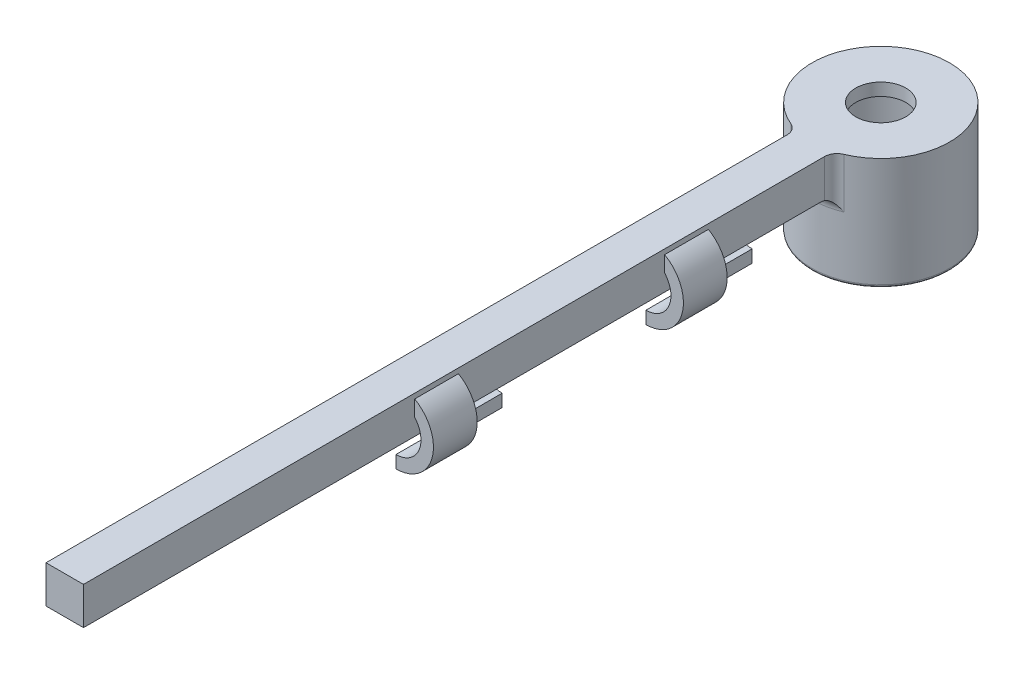
ISO-10303-21;
HEADER;
FILE_DESCRIPTION(('STEP AP214'),'2;1');
FILE_NAME('part.step','',(''),(''),'','','');
FILE_SCHEMA(('AUTOMOTIVE_DESIGN { 1 0 10303 214 1 1 1 1 }'));
ENDSEC;
DATA;
#1=APPLICATION_CONTEXT('core data for automotive mechanical design processes');
#2=APPLICATION_PROTOCOL_DEFINITION('international standard','automotive_design',2000,#1);
#3=PRODUCT_CONTEXT('',#1,'mechanical');
#4=PRODUCT('Part','Part','',(#3));
#5=PRODUCT_RELATED_PRODUCT_CATEGORY('part','',(#4));
#6=PRODUCT_DEFINITION_FORMATION('','',#4);
#7=PRODUCT_DEFINITION_CONTEXT('part definition',#1,'design');
#8=PRODUCT_DEFINITION('design','',#6,#7);
#9=PRODUCT_DEFINITION_SHAPE('','',#8);
#10=(LENGTH_UNIT() NAMED_UNIT(*) SI_UNIT(.MILLI.,.METRE.));
#11=(NAMED_UNIT(*) PLANE_ANGLE_UNIT() SI_UNIT($,.RADIAN.));
#12=(NAMED_UNIT(*) SI_UNIT($,.STERADIAN.) SOLID_ANGLE_UNIT());
#13=UNCERTAINTY_MEASURE_WITH_UNIT(LENGTH_MEASURE(1.E-05),#10,'distance_accuracy_value','');
#14=(GEOMETRIC_REPRESENTATION_CONTEXT(3) GLOBAL_UNCERTAINTY_ASSIGNED_CONTEXT((#13)) GLOBAL_UNIT_ASSIGNED_CONTEXT((#10,
#11,#12)) REPRESENTATION_CONTEXT('',''));
#15=CARTESIAN_POINT('',(0.,0.,0.));
#16=DIRECTION('',(0.,0.,1.));
#17=DIRECTION('',(1.,0.,0.));
#18=AXIS2_PLACEMENT_3D('',#15,#16,#17);
#19=CARTESIAN_POINT('',(0.,-9.,0.));
#20=DIRECTION('',(0.,1.,0.));
#21=DIRECTION('',(0.,0.,1.));
#22=AXIS2_PLACEMENT_3D('',#19,#20,#21);
#23=CYLINDRICAL_SURFACE('',#22,5.5);
#24=CARTESIAN_POINT('',(0.,-8.75,0.));
#25=DIRECTION('',(0.,1.,0.));
#26=DIRECTION('',(0.,0.,1.));
#27=AXIS2_PLACEMENT_3D('',#24,#25,#26);
#28=CIRCLE('',#27,5.5);
#29=CARTESIAN_POINT('',(0.,-8.75,5.5));
#30=VERTEX_POINT('',#29);
#31=EDGE_CURVE('E403',#30,#30,#28,.T.);
#32=ORIENTED_EDGE('',*,*,#31,.T.);
#33=EDGE_LOOP('',(#32));
#34=FACE_BOUND('',#33,.T.);
#35=DIRECTION('',(0.,1.,0.));
#36=VECTOR('',#35,1.);
#37=CARTESIAN_POINT('',(2.11538461538462,-9.,5.07692307692308));
#38=LINE('',#37,#36);
#39=CARTESIAN_POINT('',(2.11538461538462,0.,5.07692307692308));
#40=VERTEX_POINT('',#39);
#41=CARTESIAN_POINT('',(2.11538461538462,-4.,5.07692307692308));
#42=VERTEX_POINT('',#41);
#43=EDGE_CURVE('E315',#40,#42,#38,.F.);
#44=ORIENTED_EDGE('',*,*,#43,.T.);
#45=CARTESIAN_POINT('',(0.,-4.,0.));
#46=DIRECTION('',(0.,-1.,0.));
#47=DIRECTION('',(0.,0.,-1.));
#48=AXIS2_PLACEMENT_3D('',#45,#46,#47);
#49=CIRCLE('',#48,5.5);
#50=CARTESIAN_POINT('',(-2.11538461538461,-4.,5.07692307692308));
#51=VERTEX_POINT('',#50);
#52=EDGE_CURVE('E328',#42,#51,#49,.T.);
#53=ORIENTED_EDGE('',*,*,#52,.T.);
#54=DIRECTION('',(0.,1.,0.));
#55=VECTOR('',#54,1.);
#56=CARTESIAN_POINT('',(-2.11538461538461,-9.,5.07692307692308));
#57=LINE('',#56,#55);
#58=CARTESIAN_POINT('',(-2.11538461538461,0.,5.07692307692308));
#59=VERTEX_POINT('',#58);
#60=EDGE_CURVE('E321',#51,#59,#57,.T.);
#61=ORIENTED_EDGE('',*,*,#60,.T.);
#62=CARTESIAN_POINT('',(0.,0.,0.));
#63=DIRECTION('',(0.,1.,0.));
#64=DIRECTION('',(0.,0.,1.));
#65=AXIS2_PLACEMENT_3D('',#62,#63,#64);
#66=CIRCLE('',#65,5.5);
#67=EDGE_CURVE('E309',#40,#59,#66,.T.);
#68=ORIENTED_EDGE('',*,*,#67,.F.);
#69=EDGE_LOOP('',(#44,#53,#61,#68));
#70=FACE_BOUND('',#69,.T.);
#71=ADVANCED_FACE('F35',(#34,#70),#23,.T.);
#72=CARTESIAN_POINT('',(0.,-9.,0.));
#73=DIRECTION('',(0.,1.,0.));
#74=DIRECTION('',(0.,0.,1.));
#75=AXIS2_PLACEMENT_3D('',#72,#73,#74);
#76=PLANE('',#75);
#77=CARTESIAN_POINT('',(0.,-9.,0.));
#78=DIRECTION('',(0.,1.,0.));
#79=DIRECTION('',(0.,0.,1.));
#80=AXIS2_PLACEMENT_3D('',#77,#78,#79);
#81=CIRCLE('',#80,4.63);
#82=CARTESIAN_POINT('',(0.,-9.,4.63));
#83=VERTEX_POINT('',#82);
#84=EDGE_CURVE('E412',#83,#83,#81,.T.);
#85=ORIENTED_EDGE('',*,*,#84,.T.);
#86=EDGE_LOOP('',(#85));
#87=FACE_BOUND('',#86,.T.);
#88=CARTESIAN_POINT('',(0.,-9.,0.));
#89=DIRECTION('',(0.,1.,0.));
#90=DIRECTION('',(0.,0.,1.));
#91=AXIS2_PLACEMENT_3D('',#88,#89,#90);
#92=CIRCLE('',#91,5.25);
#93=CARTESIAN_POINT('',(0.,-9.,5.25));
#94=VERTEX_POINT('',#93);
#95=EDGE_CURVE('E406',#94,#94,#92,.F.);
#96=ORIENTED_EDGE('',*,*,#95,.T.);
#97=EDGE_LOOP('',(#96));
#98=FACE_BOUND('',#97,.T.);
#99=ADVANCED_FACE('F375',(#87,#98),#76,.F.);
#100=CARTESIAN_POINT('',(0.,0.,0.));
#101=DIRECTION('',(0.,1.,0.));
#102=DIRECTION('',(0.,0.,1.));
#103=AXIS2_PLACEMENT_3D('',#100,#101,#102);
#104=PLANE('',#103);
#105=DIRECTION('',(0.,0.,-1.));
#106=VECTOR('',#105,1.);
#107=CARTESIAN_POINT('',(1.5,0.,5.29150262212918));
#108=LINE('',#107,#106);
#109=CARTESIAN_POINT('',(1.5,0.,65.2915026221292));
#110=VERTEX_POINT('',#109);
#111=CARTESIAN_POINT('',(1.5,0.,6.));
#112=VERTEX_POINT('',#111);
#113=EDGE_CURVE('E291',#110,#112,#108,.T.);
#114=ORIENTED_EDGE('',*,*,#113,.T.);
#115=CARTESIAN_POINT('',(2.5,0.,6.));
#116=DIRECTION('',(0.,1.,0.));
#117=DIRECTION('',(0.,0.,1.));
#118=AXIS2_PLACEMENT_3D('',#115,#116,#117);
#119=CIRCLE('',#118,1.);
#120=EDGE_CURVE('E317',#112,#40,#119,.F.);
#121=ORIENTED_EDGE('',*,*,#120,.T.);
#122=ORIENTED_EDGE('',*,*,#67,.T.);
#123=CARTESIAN_POINT('',(-2.49999999999999,0.,6.));
#124=DIRECTION('',(0.,1.,0.));
#125=DIRECTION('',(0.,0.,1.));
#126=AXIS2_PLACEMENT_3D('',#123,#124,#125);
#127=CIRCLE('',#126,1.);
#128=CARTESIAN_POINT('',(-1.49999999999999,0.,6.));
#129=VERTEX_POINT('',#128);
#130=EDGE_CURVE('E323',#59,#129,#127,.F.);
#131=ORIENTED_EDGE('',*,*,#130,.T.);
#132=DIRECTION('',(0.,0.,1.));
#133=VECTOR('',#132,1.);
#134=CARTESIAN_POINT('',(-1.49999999999999,0.,5.29150262212918));
#135=LINE('',#134,#133);
#136=CARTESIAN_POINT('',(-1.49999999999999,0.,65.2915026221292));
#137=VERTEX_POINT('',#136);
#138=EDGE_CURVE('E283',#129,#137,#135,.T.);
#139=ORIENTED_EDGE('',*,*,#138,.T.);
#140=DIRECTION('',(1.,0.,0.));
#141=VECTOR('',#140,1.);
#142=CARTESIAN_POINT('',(-1.49999999999999,0.,65.2915026221292));
#143=LINE('',#142,#141);
#144=EDGE_CURVE('E278',#137,#110,#143,.T.);
#145=ORIENTED_EDGE('',*,*,#144,.T.);
#146=EDGE_LOOP('',(#114,#121,#122,#131,#139,#145));
#147=FACE_BOUND('',#146,.T.);
#148=CARTESIAN_POINT('',(0.,0.,0.));
#149=DIRECTION('',(0.,1.,0.));
#150=DIRECTION('',(0.,0.,1.));
#151=AXIS2_PLACEMENT_3D('',#148,#149,#150);
#152=CIRCLE('',#151,2.);
#153=CARTESIAN_POINT('',(0.,0.,2.));
#154=VERTEX_POINT('',#153);
#155=EDGE_CURVE('E298',#154,#154,#152,.T.);
#156=ORIENTED_EDGE('',*,*,#155,.F.);
#157=EDGE_LOOP('',(#156));
#158=FACE_BOUND('',#157,.T.);
#159=ADVANCED_FACE('F373',(#147,#158),#104,.T.);
#160=CARTESIAN_POINT('',(0.,-0.999999999999999,0.));
#161=DIRECTION('',(0.,-1.,0.));
#162=DIRECTION('',(0.,0.,-1.));
#163=AXIS2_PLACEMENT_3D('',#160,#161,#162);
#164=CYLINDRICAL_SURFACE('',#163,4.38);
#165=CARTESIAN_POINT('',(0.,-8.75,0.));
#166=DIRECTION('',(0.,1.,0.));
#167=DIRECTION('',(0.,0.,1.));
#168=AXIS2_PLACEMENT_3D('',#165,#166,#167);
#169=CIRCLE('',#168,4.38);
#170=CARTESIAN_POINT('',(0.,-8.75,4.38));
#171=VERTEX_POINT('',#170);
#172=EDGE_CURVE('E409',#171,#171,#169,.F.);
#173=ORIENTED_EDGE('',*,*,#172,.T.);
#174=EDGE_LOOP('',(#173));
#175=FACE_BOUND('',#174,.T.);
#176=CARTESIAN_POINT('',(0.,-0.999999999999999,0.));
#177=DIRECTION('',(0.,-1.,0.));
#178=DIRECTION('',(0.,0.,-1.));
#179=AXIS2_PLACEMENT_3D('',#176,#177,#178);
#180=CIRCLE('',#179,4.38);
#181=CARTESIAN_POINT('',(0.,-0.999999999999999,-4.38));
#182=VERTEX_POINT('',#181);
#183=EDGE_CURVE('E304',#182,#182,#180,.T.);
#184=ORIENTED_EDGE('',*,*,#183,.F.);
#185=EDGE_LOOP('',(#184));
#186=FACE_BOUND('',#185,.T.);
#187=ADVANCED_FACE('F369',(#175,#186),#164,.F.);
#188=CARTESIAN_POINT('',(0.,-0.999999999999999,0.));
#189=DIRECTION('',(0.,-1.,0.));
#190=DIRECTION('',(0.,0.,-1.));
#191=AXIS2_PLACEMENT_3D('',#188,#189,#190);
#192=PLANE('',#191);
#193=CARTESIAN_POINT('',(0.,-1.,0.));
#194=DIRECTION('',(0.,1.,0.));
#195=DIRECTION('',(0.,0.,1.));
#196=AXIS2_PLACEMENT_3D('',#193,#194,#195);
#197=CIRCLE('',#196,2.);
#198=CARTESIAN_POINT('',(0.,-1.,2.));
#199=VERTEX_POINT('',#198);
#200=EDGE_CURVE('E301',#199,#199,#197,.T.);
#201=ORIENTED_EDGE('',*,*,#200,.T.);
#202=EDGE_LOOP('',(#201));
#203=FACE_BOUND('',#202,.T.);
#204=ORIENTED_EDGE('',*,*,#183,.T.);
#205=EDGE_LOOP('',(#204));
#206=FACE_BOUND('',#205,.T.);
#207=ADVANCED_FACE('F365',(#203,#206),#192,.T.);
#208=CARTESIAN_POINT('',(0.,-1.,0.));
#209=DIRECTION('',(0.,1.,0.));
#210=DIRECTION('',(0.,0.,1.));
#211=AXIS2_PLACEMENT_3D('',#208,#209,#210);
#212=CYLINDRICAL_SURFACE('',#211,2.);
#213=ORIENTED_EDGE('',*,*,#200,.F.);
#214=EDGE_LOOP('',(#213));
#215=FACE_BOUND('',#214,.T.);
#216=ORIENTED_EDGE('',*,*,#155,.T.);
#217=EDGE_LOOP('',(#216));
#218=FACE_BOUND('',#217,.T.);
#219=ADVANCED_FACE('F361',(#215,#218),#212,.F.);
#220=CARTESIAN_POINT('',(-1.49999999999999,-3.,65.2915026221292));
#221=DIRECTION('',(0.,0.,1.));
#222=DIRECTION('',(1.,0.,0.));
#223=AXIS2_PLACEMENT_3D('',#220,#221,#222);
#224=PLANE('',#223);
#225=ORIENTED_EDGE('',*,*,#144,.F.);
#226=DIRECTION('',(0.,1.,0.));
#227=VECTOR('',#226,1.);
#228=CARTESIAN_POINT('',(-1.49999999999999,-3.,65.2915026221292));
#229=LINE('',#228,#227);
#230=CARTESIAN_POINT('',(-1.49999999999999,-3.,65.2915026221292));
#231=VERTEX_POINT('',#230);
#232=EDGE_CURVE('E295',#231,#137,#229,.T.);
#233=ORIENTED_EDGE('',*,*,#232,.F.);
#234=DIRECTION('',(1.,0.,0.));
#235=VECTOR('',#234,1.);
#236=CARTESIAN_POINT('',(-1.49999999999999,-3.,65.2915026221292));
#237=LINE('',#236,#235);
#238=CARTESIAN_POINT('',(1.5,-3.,65.2915026221292));
#239=VERTEX_POINT('',#238);
#240=EDGE_CURVE('E279',#231,#239,#237,.T.);
#241=ORIENTED_EDGE('',*,*,#240,.T.);
#242=DIRECTION('',(0.,1.,0.));
#243=VECTOR('',#242,1.);
#244=CARTESIAN_POINT('',(1.5,-3.,65.2915026221292));
#245=LINE('',#244,#243);
#246=EDGE_CURVE('E288',#239,#110,#245,.T.);
#247=ORIENTED_EDGE('',*,*,#246,.T.);
#248=EDGE_LOOP('',(#225,#233,#241,#247));
#249=FACE_BOUND('',#248,.T.);
#250=ADVANCED_FACE('F358',(#249),#224,.T.);
#251=CARTESIAN_POINT('',(-1.49999999999999,-3.,5.29150262212918));
#252=DIRECTION('',(-1.,0.,0.));
#253=DIRECTION('',(0.,0.,1.));
#254=AXIS2_PLACEMENT_3D('',#251,#252,#253);
#255=PLANE('',#254);
#256=DIRECTION('',(0.,1.,0.));
#257=VECTOR('',#256,1.);
#258=CARTESIAN_POINT('',(-1.49999999999999,-3.,33.7915026221292));
#259=LINE('',#258,#257);
#260=CARTESIAN_POINT('',(-1.49999999999999,-1.6771243444677,33.7915026221292));
#261=VERTEX_POINT('',#260);
#262=CARTESIAN_POINT('',(-1.49999999999999,-0.401923788646679,33.7915026221292));
#263=VERTEX_POINT('',#262);
#264=EDGE_CURVE('E11',#261,#263,#259,.T.);
#265=ORIENTED_EDGE('',*,*,#264,.F.);
#266=DIRECTION('',(0.,0.,-1.));
#267=VECTOR('',#266,1.);
#268=CARTESIAN_POINT('',(-1.49999999999999,-1.6771243444677,33.7915026221292));
#269=LINE('',#268,#267);
#270=CARTESIAN_POINT('',(-1.49999999999999,-1.6771243444677,30.2915026221292));
#271=VERTEX_POINT('',#270);
#272=EDGE_CURVE('E43',#261,#271,#269,.T.);
#273=ORIENTED_EDGE('',*,*,#272,.T.);
#274=DIRECTION('',(0.,1.,0.));
#275=VECTOR('',#274,1.);
#276=CARTESIAN_POINT('',(-1.49999999999999,-3.,30.2915026221292));
#277=LINE('',#276,#275);
#278=CARTESIAN_POINT('',(-1.49999999999999,-0.401923788646679,30.2915026221292));
#279=VERTEX_POINT('',#278);
#280=EDGE_CURVE('E448',#271,#279,#277,.T.);
#281=ORIENTED_EDGE('',*,*,#280,.T.);
#282=DIRECTION('',(0.,0.,-1.));
#283=VECTOR('',#282,1.);
#284=CARTESIAN_POINT('',(-1.49999999999999,-0.401923788646679,33.7915026221292));
#285=LINE('',#284,#283);
#286=EDGE_CURVE('E451',#279,#263,#285,.F.);
#287=ORIENTED_EDGE('',*,*,#286,.T.);
#288=EDGE_LOOP('',(#265,#273,#281,#287));
#289=FACE_BOUND('',#288,.T.);
#290=DIRECTION('',(0.,1.,0.));
#291=VECTOR('',#290,1.);
#292=CARTESIAN_POINT('',(-1.49999999999999,-3.,13.7915026221292));
#293=LINE('',#292,#291);
#294=CARTESIAN_POINT('',(-1.49999999999999,-1.6771243444677,13.7915026221292));
#295=VERTEX_POINT('',#294);
#296=CARTESIAN_POINT('',(-1.49999999999999,-0.401923788646681,13.7915026221292));
#297=VERTEX_POINT('',#296);
#298=EDGE_CURVE('E424',#295,#297,#293,.T.);
#299=ORIENTED_EDGE('',*,*,#298,.F.);
#300=DIRECTION('',(0.,0.,-1.));
#301=VECTOR('',#300,1.);
#302=CARTESIAN_POINT('',(-1.49999999999999,-1.6771243444677,13.7915026221292));
#303=LINE('',#302,#301);
#304=CARTESIAN_POINT('',(-1.49999999999999,-1.6771243444677,10.2915026221292));
#305=VERTEX_POINT('',#304);
#306=EDGE_CURVE('E421',#295,#305,#303,.T.);
#307=ORIENTED_EDGE('',*,*,#306,.T.);
#308=DIRECTION('',(0.,1.,0.));
#309=VECTOR('',#308,1.);
#310=CARTESIAN_POINT('',(-1.49999999999999,-3.,10.2915026221292));
#311=LINE('',#310,#309);
#312=CARTESIAN_POINT('',(-1.49999999999999,-0.401923788646681,10.2915026221292));
#313=VERTEX_POINT('',#312);
#314=EDGE_CURVE('E415',#305,#313,#311,.T.);
#315=ORIENTED_EDGE('',*,*,#314,.T.);
#316=DIRECTION('',(0.,0.,-1.));
#317=VECTOR('',#316,1.);
#318=CARTESIAN_POINT('',(-1.49999999999999,-0.401923788646681,13.7915026221292));
#319=LINE('',#318,#317);
#320=EDGE_CURVE('E418',#313,#297,#319,.F.);
#321=ORIENTED_EDGE('',*,*,#320,.T.);
#322=EDGE_LOOP('',(#299,#307,#315,#321));
#323=FACE_BOUND('',#322,.T.);
#324=ORIENTED_EDGE('',*,*,#138,.F.);
#325=DIRECTION('',(0.,-1.,0.));
#326=VECTOR('',#325,1.);
#327=CARTESIAN_POINT('',(-1.49999999999999,-3.,6.));
#328=LINE('',#327,#326);
#329=CARTESIAN_POINT('',(-1.49999999999999,-3.05102176023663,6.));
#330=VERTEX_POINT('',#329);
#331=EDGE_CURVE('E319',#129,#330,#328,.T.);
#332=ORIENTED_EDGE('',*,*,#331,.T.);
#333=CARTESIAN_POINT('',(-1.49999999999999,-3.05102176023663,6.));
#334=CARTESIAN_POINT('',(-1.49999999999999,-3.03406974968747,6.05276391951299));
#335=CARTESIAN_POINT('',(-1.49999999999999,-3.02134193130793,6.10619190673131));
#336=CARTESIAN_POINT('',(-1.49999999999999,-3.00433452591979,6.21437698961873));
#337=CARTESIAN_POINT('',(-1.49999999999999,-3.00005509088712,6.26913410917932));
#338=CARTESIAN_POINT('',(-1.49999999999999,-3.,6.32455532033676));
#339=B_SPLINE_CURVE_WITH_KNOTS('',3,(#333,#334,#335,#336,#337,#338),.UNSPECIFIED.,.F.,.F.,(4,2,
4),(0.,0.164769307245432,0.329541578459206),.UNSPECIFIED.);
#340=CARTESIAN_POINT('',(-1.49999999999999,-3.,6.32455532033676));
#341=VERTEX_POINT('',#340);
#342=EDGE_CURVE('E398',#330,#341,#339,.T.);
#343=ORIENTED_EDGE('',*,*,#342,.T.);
#344=DIRECTION('',(0.,0.,1.));
#345=VECTOR('',#344,1.);
#346=CARTESIAN_POINT('',(-1.49999999999999,-3.,5.29150262212918));
#347=LINE('',#346,#345);
#348=EDGE_CURVE('E286',#341,#231,#347,.T.);
#349=ORIENTED_EDGE('',*,*,#348,.T.);
#350=ORIENTED_EDGE('',*,*,#232,.T.);
#351=EDGE_LOOP('',(#324,#332,#343,#349,#350));
#352=FACE_BOUND('',#351,.T.);
#353=ADVANCED_FACE('F354',(#289,#323,#352),#255,.T.);
#354=CARTESIAN_POINT('',(1.5,-3.,5.29150262212918));
#355=DIRECTION('',(1.,0.,0.));
#356=DIRECTION('',(0.,0.,-1.));
#357=AXIS2_PLACEMENT_3D('',#354,#355,#356);
#358=PLANE('',#357);
#359=DIRECTION('',(0.,-1.,0.));
#360=VECTOR('',#359,1.);
#361=CARTESIAN_POINT('',(1.5,-3.,18.7915026221292));
#362=LINE('',#361,#360);
#363=CARTESIAN_POINT('',(1.5,-0.401923788646684,18.7915026221292));
#364=VERTEX_POINT('',#363);
#365=CARTESIAN_POINT('',(1.5,-1.67712434446771,18.7915026221292));
#366=VERTEX_POINT('',#365);
#367=EDGE_CURVE('E446',#364,#366,#362,.T.);
#368=ORIENTED_EDGE('',*,*,#367,.F.);
#369=DIRECTION('',(0.,0.,-1.));
#370=VECTOR('',#369,1.);
#371=CARTESIAN_POINT('',(1.5,-0.401923788646684,18.7915026221292));
#372=LINE('',#371,#370);
#373=CARTESIAN_POINT('',(1.5,-0.401923788646684,15.2915026221292));
#374=VERTEX_POINT('',#373);
#375=EDGE_CURVE('E440',#364,#374,#372,.T.);
#376=ORIENTED_EDGE('',*,*,#375,.T.);
#377=DIRECTION('',(0.,-1.,0.));
#378=VECTOR('',#377,1.);
#379=CARTESIAN_POINT('',(1.5,-3.,15.2915026221292));
#380=LINE('',#379,#378);
#381=CARTESIAN_POINT('',(1.5,-1.67712434446771,15.2915026221292));
#382=VERTEX_POINT('',#381);
#383=EDGE_CURVE('E437',#374,#382,#380,.T.);
#384=ORIENTED_EDGE('',*,*,#383,.T.);
#385=DIRECTION('',(0.,0.,-1.));
#386=VECTOR('',#385,1.);
#387=CARTESIAN_POINT('',(1.5,-1.67712434446771,18.7915026221292));
#388=LINE('',#387,#386);
#389=EDGE_CURVE('E443',#382,#366,#388,.F.);
#390=ORIENTED_EDGE('',*,*,#389,.T.);
#391=EDGE_LOOP('',(#368,#376,#384,#390));
#392=FACE_BOUND('',#391,.T.);
#393=DIRECTION('',(0.,-1.,0.));
#394=VECTOR('',#393,1.);
#395=CARTESIAN_POINT('',(1.5,-3.,38.7915026221292));
#396=LINE('',#395,#394);
#397=CARTESIAN_POINT('',(1.5,-0.401923788646684,38.7915026221292));
#398=VERTEX_POINT('',#397);
#399=CARTESIAN_POINT('',(1.5,-1.6771243444677,38.7915026221292));
#400=VERTEX_POINT('',#399);
#401=EDGE_CURVE('E435',#398,#400,#396,.T.);
#402=ORIENTED_EDGE('',*,*,#401,.F.);
#403=DIRECTION('',(0.,0.,-1.));
#404=VECTOR('',#403,1.);
#405=CARTESIAN_POINT('',(1.5,-0.401923788646684,38.7915026221292));
#406=LINE('',#405,#404);
#407=CARTESIAN_POINT('',(1.5,-0.401923788646684,35.2915026221292));
#408=VERTEX_POINT('',#407);
#409=EDGE_CURVE('E429',#398,#408,#406,.T.);
#410=ORIENTED_EDGE('',*,*,#409,.T.);
#411=DIRECTION('',(0.,-1.,0.));
#412=VECTOR('',#411,1.);
#413=CARTESIAN_POINT('',(1.5,-3.,35.2915026221292));
#414=LINE('',#413,#412);
#415=CARTESIAN_POINT('',(1.5,-1.6771243444677,35.2915026221292));
#416=VERTEX_POINT('',#415);
#417=EDGE_CURVE('E426',#408,#416,#414,.T.);
#418=ORIENTED_EDGE('',*,*,#417,.T.);
#419=DIRECTION('',(0.,0.,-1.));
#420=VECTOR('',#419,1.);
#421=CARTESIAN_POINT('',(1.5,-1.6771243444677,38.7915026221292));
#422=LINE('',#421,#420);
#423=EDGE_CURVE('E432',#416,#400,#422,.F.);
#424=ORIENTED_EDGE('',*,*,#423,.T.);
#425=EDGE_LOOP('',(#402,#410,#418,#424));
#426=FACE_BOUND('',#425,.T.);
#427=DIRECTION('',(0.,0.,-1.));
#428=VECTOR('',#427,1.);
#429=CARTESIAN_POINT('',(1.5,-3.,5.29150262212918));
#430=LINE('',#429,#428);
#431=CARTESIAN_POINT('',(1.5,-3.,6.32455532033676));
#432=VERTEX_POINT('',#431);
#433=EDGE_CURVE('E282',#239,#432,#430,.T.);
#434=ORIENTED_EDGE('',*,*,#433,.T.);
#435=CARTESIAN_POINT('',(1.5,-3.,6.32455532033676));
#436=CARTESIAN_POINT('',(1.5,-3.00005509088712,6.26913410917932));
#437=CARTESIAN_POINT('',(1.5,-3.00433452591979,6.21437698961873));
#438=CARTESIAN_POINT('',(1.5,-3.02134193130793,6.10619190673131));
#439=CARTESIAN_POINT('',(1.5,-3.03406974968747,6.05276391951298));
#440=CARTESIAN_POINT('',(1.5,-3.05102176023663,6.));
#441=B_SPLINE_CURVE_WITH_KNOTS('',3,(#435,#436,#437,#438,#439,#440),.UNSPECIFIED.,.F.,.F.,(4,2,
4),(0.,0.164772271213777,0.32954157845921),.UNSPECIFIED.);
#442=CARTESIAN_POINT('',(1.5,-3.05102176023663,6.));
#443=VERTEX_POINT('',#442);
#444=EDGE_CURVE('E331',#432,#443,#441,.T.);
#445=ORIENTED_EDGE('',*,*,#444,.T.);
#446=DIRECTION('',(0.,-1.,0.));
#447=VECTOR('',#446,1.);
#448=CARTESIAN_POINT('',(1.5,0.,6.));
#449=LINE('',#448,#447);
#450=EDGE_CURVE('E312',#443,#112,#449,.F.);
#451=ORIENTED_EDGE('',*,*,#450,.T.);
#452=ORIENTED_EDGE('',*,*,#113,.F.);
#453=ORIENTED_EDGE('',*,*,#246,.F.);
#454=EDGE_LOOP('',(#434,#445,#451,#452,#453));
#455=FACE_BOUND('',#454,.T.);
#456=ADVANCED_FACE('F348',(#392,#426,#455),#358,.T.);
#457=CARTESIAN_POINT('',(-0.0105594343899873,-3.,-0.286754057259299));
#458=DIRECTION('',(0.,-1.,0.));
#459=DIRECTION('',(0.,0.,-1.));
#460=AXIS2_PLACEMENT_3D('',#457,#458,#459);
#461=PLANE('',#460);
#462=ORIENTED_EDGE('',*,*,#348,.F.);
#463=CARTESIAN_POINT('',(0.,-3.,0.));
#464=DIRECTION('',(0.,-1.,0.));
#465=DIRECTION('',(0.,0.,-1.));
#466=AXIS2_PLACEMENT_3D('',#463,#464,#465);
#467=CIRCLE('',#466,6.5);
#468=EDGE_CURVE('E325',#341,#432,#467,.F.);
#469=ORIENTED_EDGE('',*,*,#468,.T.);
#470=ORIENTED_EDGE('',*,*,#433,.F.);
#471=ORIENTED_EDGE('',*,*,#240,.F.);
#472=EDGE_LOOP('',(#462,#469,#470,#471));
#473=FACE_BOUND('',#472,.T.);
#474=ADVANCED_FACE('F353',(#473),#461,.T.);
#475=CARTESIAN_POINT('',(2.5,-9.,6.));
#476=DIRECTION('',(0.,1.,0.));
#477=DIRECTION('',(0.,0.,1.));
#478=AXIS2_PLACEMENT_3D('',#475,#476,#477);
#479=CYLINDRICAL_SURFACE('',#478,1.);
#480=ORIENTED_EDGE('',*,*,#450,.F.);
#481=CARTESIAN_POINT('',(1.5,-3.05102176023663,6.));
#482=CARTESIAN_POINT('',(1.49999719902262,-3.0684458523044,5.94586472167182));
#483=CARTESIAN_POINT('',(1.50438456628936,-3.08984290094301,5.89341637606796));
#484=CARTESIAN_POINT('',(1.5203024208252,-3.13859130977469,5.79331194805032));
#485=CARTESIAN_POINT('',(1.53174050887214,-3.16586272640564,5.74560299973876));
#486=CARTESIAN_POINT('',(1.56417947771397,-3.23315313117927,5.64230039723698));
#487=CARTESIAN_POINT('',(1.58695967855335,-3.27460456383148,5.58823039263899));
#488=CARTESIAN_POINT('',(1.63935526495356,-3.36258095165774,5.48762598108026));
#489=CARTESIAN_POINT('',(1.66901490834403,-3.40913768197743,5.44114383849935));
#490=CARTESIAN_POINT('',(1.74789118369545,-3.52703241001769,5.33639931071978));
#491=CARTESIAN_POINT('',(1.79990819084686,-3.60010818933876,5.28222393904641));
#492=CARTESIAN_POINT('',(1.91144187885659,-3.74923177247216,5.18827241839595));
#493=CARTESIAN_POINT('',(1.97094400852389,-3.82527361748143,5.14846889623919));
#494=CARTESIAN_POINT('',(2.05895247323203,-3.93286423068571,5.10205596005287));
#495=CARTESIAN_POINT('',(2.08495550634361,-3.96410359681272,5.08974514419146));
#496=CARTESIAN_POINT('',(2.11275086888095,-3.9968968336274,5.07802377968282));
#497=CARTESIAN_POINT('',(2.11406715499667,-3.99844841763109,5.07747201710072));
#498=CARTESIAN_POINT('',(2.11538461538462,-4.,5.07692307692308));
#499=B_SPLINE_CURVE_WITH_KNOTS('',3,(#481,#482,#483,#484,#485,#486,#487,#488,#489,#490,#491,
#492,#493,#494,#495,#496,#497,#498),.UNSPECIFIED.,.F.,.F.,(4,2,2,2,2,2,2,2,4),(0.,
0.1697155467501,0.337252922773086,0.551620472821234,0.767407373446595,1.08012216542673,
1.39223816716043,1.51958578376324,1.52591034572664),.UNSPECIFIED.);
#500=EDGE_CURVE('E339',#443,#42,#499,.T.);
#501=ORIENTED_EDGE('',*,*,#500,.T.);
#502=ORIENTED_EDGE('',*,*,#43,.F.);
#503=ORIENTED_EDGE('',*,*,#120,.F.);
#504=EDGE_LOOP('',(#480,#501,#502,#503));
#505=FACE_BOUND('',#504,.T.);
#506=ADVANCED_FACE('F384',(#505),#479,.F.);
#507=CARTESIAN_POINT('',(-2.49999999999999,-9.,6.));
#508=DIRECTION('',(0.,1.,0.));
#509=DIRECTION('',(0.,0.,1.));
#510=AXIS2_PLACEMENT_3D('',#507,#508,#509);
#511=CYLINDRICAL_SURFACE('',#510,1.);
#512=ORIENTED_EDGE('',*,*,#130,.F.);
#513=ORIENTED_EDGE('',*,*,#60,.F.);
#514=CARTESIAN_POINT('',(-1.49999999999999,-3.05102176023663,6.));
#515=CARTESIAN_POINT('',(-1.49999719902261,-3.0684458523044,5.94586472167182));
#516=CARTESIAN_POINT('',(-1.50438456628936,-3.08984290094301,5.89341637606796));
#517=CARTESIAN_POINT('',(-1.52030242082519,-3.13859130977469,5.79331194805032));
#518=CARTESIAN_POINT('',(-1.53174050887213,-3.16586272640564,5.74560299973876));
#519=CARTESIAN_POINT('',(-1.56417947771396,-3.23315313117926,5.64230039723698));
#520=CARTESIAN_POINT('',(-1.58695967855334,-3.27460456383148,5.588230392639));
#521=CARTESIAN_POINT('',(-1.63935526495356,-3.36258095165774,5.48762598108026));
#522=CARTESIAN_POINT('',(-1.66901490834403,-3.40913768197742,5.44114383849935));
#523=CARTESIAN_POINT('',(-1.74789118369544,-3.52703241001769,5.33639931071979));
#524=CARTESIAN_POINT('',(-1.79990819084685,-3.60010818933877,5.28222393904641));
#525=CARTESIAN_POINT('',(-1.91144187885659,-3.74923177247215,5.18827241839595));
#526=CARTESIAN_POINT('',(-1.97094400852391,-3.8252736174814,5.14846889623918));
#527=CARTESIAN_POINT('',(-2.05895247323201,-3.93286423068572,5.10205596005288));
#528=CARTESIAN_POINT('',(-2.08495550634357,-3.96410359681275,5.08974514419148));
#529=CARTESIAN_POINT('',(-2.11275086888095,-3.99689683362741,5.07802377968282));
#530=CARTESIAN_POINT('',(-2.11406715499666,-3.99844841763109,5.07747201710072));
#531=CARTESIAN_POINT('',(-2.11538461538461,-4.,5.07692307692308));
#532=B_SPLINE_CURVE_WITH_KNOTS('',3,(#514,#515,#516,#517,#518,#519,#520,#521,#522,#523,#524,
#525,#526,#527,#528,#529,#530,#531),.UNSPECIFIED.,.F.,.F.,(4,2,2,2,2,2,2,2,4),(0.,
0.169715546750101,0.337252922773084,0.551620472821232,0.767407373446593,1.08012216542673,
1.39223816716043,1.51958578376324,1.52591034572664),.UNSPECIFIED.);
#533=EDGE_CURVE('E392',#51,#330,#532,.F.);
#534=ORIENTED_EDGE('',*,*,#533,.T.);
#535=ORIENTED_EDGE('',*,*,#331,.F.);
#536=EDGE_LOOP('',(#512,#513,#534,#535));
#537=FACE_BOUND('',#536,.T.);
#538=ADVANCED_FACE('F387',(#537),#511,.F.);
#539=CARTESIAN_POINT('',(0.,-4.,0.));
#540=DIRECTION('',(0.,-1.,0.));
#541=DIRECTION('',(0.,0.,-1.));
#542=AXIS2_PLACEMENT_3D('',#539,#540,#541);
#543=TOROIDAL_SURFACE('',#542,6.5,1.);
#544=ORIENTED_EDGE('',*,*,#533,.F.);
#545=ORIENTED_EDGE('',*,*,#52,.F.);
#546=ORIENTED_EDGE('',*,*,#500,.F.);
#547=ORIENTED_EDGE('',*,*,#444,.F.);
#548=ORIENTED_EDGE('',*,*,#468,.F.);
#549=ORIENTED_EDGE('',*,*,#342,.F.);
#550=EDGE_LOOP('',(#544,#545,#546,#547,#548,#549));
#551=FACE_BOUND('',#550,.T.);
#552=ADVANCED_FACE('F345',(#551),#543,.F.);
#553=CARTESIAN_POINT('',(0.,-8.75,0.));
#554=DIRECTION('',(0.,1.,0.));
#555=DIRECTION('',(0.,0.,1.));
#556=AXIS2_PLACEMENT_3D('',#553,#554,#555);
#557=TOROIDAL_SURFACE('',#556,5.25,0.25);
#558=ORIENTED_EDGE('',*,*,#95,.F.);
#559=EDGE_LOOP('',(#558));
#560=FACE_BOUND('',#559,.T.);
#561=ORIENTED_EDGE('',*,*,#31,.F.);
#562=EDGE_LOOP('',(#561));
#563=FACE_BOUND('',#562,.T.);
#564=ADVANCED_FACE('F657',(#560,#563),#557,.T.);
#565=CARTESIAN_POINT('',(0.,-8.75,0.));
#566=DIRECTION('',(0.,1.,0.));
#567=DIRECTION('',(0.,0.,1.));
#568=AXIS2_PLACEMENT_3D('',#565,#566,#567);
#569=TOROIDAL_SURFACE('',#568,4.63,0.25);
#570=ORIENTED_EDGE('',*,*,#84,.F.);
#571=EDGE_LOOP('',(#570));
#572=FACE_BOUND('',#571,.T.);
#573=ORIENTED_EDGE('',*,*,#172,.F.);
#574=EDGE_LOOP('',(#573));
#575=FACE_BOUND('',#574,.T.);
#576=ADVANCED_FACE('F37',(#572,#575),#569,.T.);
#577=CARTESIAN_POINT('',(0.,-3.,13.7915026221292));
#578=DIRECTION('',(0.,0.,-1.));
#579=DIRECTION('',(-1.,0.,0.));
#580=AXIS2_PLACEMENT_3D('',#577,#578,#579);
#581=CYLINDRICAL_SURFACE('',#580,2.);
#582=ORIENTED_EDGE('',*,*,#306,.F.);
#583=CARTESIAN_POINT('',(0.,-3.,13.7915026221292));
#584=DIRECTION('',(0.,0.,-1.));
#585=DIRECTION('',(1.,0.,0.));
#586=AXIS2_PLACEMENT_3D('',#583,#584,#585);
#587=CIRCLE('',#586,2.);
#588=CARTESIAN_POINT('',(0.,-5.,13.7915026221292));
#589=VERTEX_POINT('',#588);
#590=EDGE_CURVE('E259',#589,#295,#587,.T.);
#591=ORIENTED_EDGE('',*,*,#590,.F.);
#592=DIRECTION('',(0.,0.,-1.));
#593=VECTOR('',#592,1.);
#594=CARTESIAN_POINT('',(0.,-5.,13.7915026221292));
#595=LINE('',#594,#593);
#596=CARTESIAN_POINT('',(0.,-5.,10.2915026221292));
#597=VERTEX_POINT('',#596);
#598=EDGE_CURVE('E267',#589,#597,#595,.T.);
#599=ORIENTED_EDGE('',*,*,#598,.T.);
#600=CARTESIAN_POINT('',(0.,-3.,10.2915026221292));
#601=DIRECTION('',(0.,0.,-1.));
#602=DIRECTION('',(1.,0.,0.));
#603=AXIS2_PLACEMENT_3D('',#600,#601,#602);
#604=CIRCLE('',#603,2.);
#605=EDGE_CURVE('E258',#597,#305,#604,.T.);
#606=ORIENTED_EDGE('',*,*,#605,.T.);
#607=EDGE_LOOP('',(#582,#591,#599,#606));
#608=FACE_BOUND('',#607,.T.);
#609=ADVANCED_FACE('F526',(#608),#581,.F.);
#610=CARTESIAN_POINT('',(0.,-3.,13.7915026221292));
#611=DIRECTION('',(0.,0.,-1.));
#612=DIRECTION('',(-1.,0.,0.));
#613=AXIS2_PLACEMENT_3D('',#610,#611,#612);
#614=CYLINDRICAL_SURFACE('',#613,3.);
#615=ORIENTED_EDGE('',*,*,#320,.F.);
#616=CARTESIAN_POINT('',(0.,-3.,10.2915026221292));
#617=DIRECTION('',(0.,0.,1.));
#618=DIRECTION('',(1.,0.,0.));
#619=AXIS2_PLACEMENT_3D('',#616,#617,#618);
#620=CIRCLE('',#619,3.);
#621=CARTESIAN_POINT('',(0.,-6.,10.2915026221292));
#622=VERTEX_POINT('',#621);
#623=EDGE_CURVE('E270',#313,#622,#620,.T.);
#624=ORIENTED_EDGE('',*,*,#623,.T.);
#625=DIRECTION('',(0.,0.,-1.));
#626=VECTOR('',#625,1.);
#627=CARTESIAN_POINT('',(0.,-6.,13.7915026221292));
#628=LINE('',#627,#626);
#629=CARTESIAN_POINT('',(0.,-6.,13.7915026221292));
#630=VERTEX_POINT('',#629);
#631=EDGE_CURVE('E275',#630,#622,#628,.T.);
#632=ORIENTED_EDGE('',*,*,#631,.F.);
#633=CARTESIAN_POINT('',(0.,-3.,13.7915026221292));
#634=DIRECTION('',(0.,0.,1.));
#635=DIRECTION('',(1.,0.,0.));
#636=AXIS2_PLACEMENT_3D('',#633,#634,#635);
#637=CIRCLE('',#636,3.);
#638=EDGE_CURVE('E262',#297,#630,#637,.T.);
#639=ORIENTED_EDGE('',*,*,#638,.F.);
#640=EDGE_LOOP('',(#615,#624,#632,#639));
#641=FACE_BOUND('',#640,.T.);
#642=ADVANCED_FACE('F522',(#641),#614,.T.);
#643=CARTESIAN_POINT('',(0.,-5.,13.7915026221292));
#644=DIRECTION('',(-1.,0.,0.));
#645=DIRECTION('',(0.,-1.,0.));
#646=AXIS2_PLACEMENT_3D('',#643,#644,#645);
#647=PLANE('',#646);
#648=DIRECTION('',(0.,1.,0.));
#649=VECTOR('',#648,1.);
#650=CARTESIAN_POINT('',(0.,-5.,10.2915026221292));
#651=LINE('',#650,#649);
#652=EDGE_CURVE('E263',#622,#597,#651,.T.);
#653=ORIENTED_EDGE('',*,*,#652,.T.);
#654=ORIENTED_EDGE('',*,*,#598,.F.);
#655=DIRECTION('',(0.,1.,0.));
#656=VECTOR('',#655,1.);
#657=CARTESIAN_POINT('',(0.,-5.,13.7915026221292));
#658=LINE('',#657,#656);
#659=EDGE_CURVE('E265',#630,#589,#658,.T.);
#660=ORIENTED_EDGE('',*,*,#659,.F.);
#661=ORIENTED_EDGE('',*,*,#631,.T.);
#662=EDGE_LOOP('',(#653,#654,#660,#661));
#663=FACE_BOUND('',#662,.T.);
#664=ADVANCED_FACE('F515',(#663),#647,.F.);
#665=CARTESIAN_POINT('',(0.,-3.,13.7915026221292));
#666=DIRECTION('',(0.,0.,1.));
#667=DIRECTION('',(1.,0.,0.));
#668=AXIS2_PLACEMENT_3D('',#665,#666,#667);
#669=PLANE('',#668);
#670=ORIENTED_EDGE('',*,*,#590,.T.);
#671=ORIENTED_EDGE('',*,*,#298,.T.);
#672=ORIENTED_EDGE('',*,*,#638,.T.);
#673=ORIENTED_EDGE('',*,*,#659,.T.);
#674=EDGE_LOOP('',(#670,#671,#672,#673));
#675=FACE_BOUND('',#674,.T.);
#676=ADVANCED_FACE('F512',(#675),#669,.T.);
#677=CARTESIAN_POINT('',(0.,-3.,10.2915026221292));
#678=DIRECTION('',(0.,0.,1.));
#679=DIRECTION('',(1.,0.,0.));
#680=AXIS2_PLACEMENT_3D('',#677,#678,#679);
#681=PLANE('',#680);
#682=ORIENTED_EDGE('',*,*,#314,.F.);
#683=ORIENTED_EDGE('',*,*,#605,.F.);
#684=ORIENTED_EDGE('',*,*,#652,.F.);
#685=ORIENTED_EDGE('',*,*,#623,.F.);
#686=EDGE_LOOP('',(#682,#683,#684,#685));
#687=FACE_BOUND('',#686,.T.);
#688=ADVANCED_FACE('F510',(#687),#681,.F.);
#689=CARTESIAN_POINT('',(0.,-3.,38.7915026221292));
#690=DIRECTION('',(0.,0.,-1.));
#691=DIRECTION('',(-1.,0.,0.));
#692=AXIS2_PLACEMENT_3D('',#689,#690,#691);
#693=CYLINDRICAL_SURFACE('',#692,2.);
#694=ORIENTED_EDGE('',*,*,#423,.F.);
#695=CARTESIAN_POINT('',(0.,-3.,35.2915026221292));
#696=DIRECTION('',(0.,0.,-1.));
#697=DIRECTION('',(1.,0.,0.));
#698=AXIS2_PLACEMENT_3D('',#695,#696,#697);
#699=CIRCLE('',#698,2.);
#700=CARTESIAN_POINT('',(0.,-5.,35.2915026221292));
#701=VERTEX_POINT('',#700);
#702=EDGE_CURVE('E238',#416,#701,#699,.T.);
#703=ORIENTED_EDGE('',*,*,#702,.T.);
#704=DIRECTION('',(0.,0.,-1.));
#705=VECTOR('',#704,1.);
#706=CARTESIAN_POINT('',(0.,-5.,38.7915026221292));
#707=LINE('',#706,#705);
#708=CARTESIAN_POINT('',(0.,-5.,38.7915026221292));
#709=VERTEX_POINT('',#708);
#710=EDGE_CURVE('E255',#709,#701,#707,.T.);
#711=ORIENTED_EDGE('',*,*,#710,.F.);
#712=CARTESIAN_POINT('',(0.,-3.,38.7915026221292));
#713=DIRECTION('',(0.,0.,-1.));
#714=DIRECTION('',(1.,0.,0.));
#715=AXIS2_PLACEMENT_3D('',#712,#713,#714);
#716=CIRCLE('',#715,2.);
#717=EDGE_CURVE('E239',#400,#709,#716,.T.);
#718=ORIENTED_EDGE('',*,*,#717,.F.);
#719=EDGE_LOOP('',(#694,#703,#711,#718));
#720=FACE_BOUND('',#719,.T.);
#721=ADVANCED_FACE('F506',(#720),#693,.F.);
#722=CARTESIAN_POINT('',(0.,-5.,38.7915026221292));
#723=DIRECTION('',(1.,0.,0.));
#724=DIRECTION('',(0.,1.,0.));
#725=AXIS2_PLACEMENT_3D('',#722,#723,#724);
#726=PLANE('',#725);
#727=DIRECTION('',(0.,-1.,0.));
#728=VECTOR('',#727,1.);
#729=CARTESIAN_POINT('',(0.,-5.,35.2915026221292));
#730=LINE('',#729,#728);
#731=CARTESIAN_POINT('',(0.,-6.,35.2915026221292));
#732=VERTEX_POINT('',#731);
#733=EDGE_CURVE('E249',#701,#732,#730,.T.);
#734=ORIENTED_EDGE('',*,*,#733,.T.);
#735=DIRECTION('',(0.,0.,-1.));
#736=VECTOR('',#735,1.);
#737=CARTESIAN_POINT('',(0.,-6.,38.7915026221292));
#738=LINE('',#737,#736);
#739=CARTESIAN_POINT('',(0.,-6.,38.7915026221292));
#740=VERTEX_POINT('',#739);
#741=EDGE_CURVE('E247',#740,#732,#738,.T.);
#742=ORIENTED_EDGE('',*,*,#741,.F.);
#743=DIRECTION('',(0.,-1.,0.));
#744=VECTOR('',#743,1.);
#745=CARTESIAN_POINT('',(0.,-5.,38.7915026221292));
#746=LINE('',#745,#744);
#747=EDGE_CURVE('E241',#709,#740,#746,.T.);
#748=ORIENTED_EDGE('',*,*,#747,.F.);
#749=ORIENTED_EDGE('',*,*,#710,.T.);
#750=EDGE_LOOP('',(#734,#742,#748,#749));
#751=FACE_BOUND('',#750,.T.);
#752=ADVANCED_FACE('F502',(#751),#726,.F.);
#753=CARTESIAN_POINT('',(0.,-3.,38.7915026221292));
#754=DIRECTION('',(0.,0.,-1.));
#755=DIRECTION('',(-1.,0.,0.));
#756=AXIS2_PLACEMENT_3D('',#753,#754,#755);
#757=CYLINDRICAL_SURFACE('',#756,3.);
#758=ORIENTED_EDGE('',*,*,#409,.F.);
#759=CARTESIAN_POINT('',(0.,-3.,38.7915026221292));
#760=DIRECTION('',(0.,0.,1.));
#761=DIRECTION('',(1.,0.,0.));
#762=AXIS2_PLACEMENT_3D('',#759,#760,#761);
#763=CIRCLE('',#762,3.);
#764=EDGE_CURVE('E244',#740,#398,#763,.T.);
#765=ORIENTED_EDGE('',*,*,#764,.F.);
#766=ORIENTED_EDGE('',*,*,#741,.T.);
#767=CARTESIAN_POINT('',(0.,-3.,35.2915026221292));
#768=DIRECTION('',(0.,0.,1.));
#769=DIRECTION('',(1.,0.,0.));
#770=AXIS2_PLACEMENT_3D('',#767,#768,#769);
#771=CIRCLE('',#770,3.);
#772=EDGE_CURVE('E242',#732,#408,#771,.T.);
#773=ORIENTED_EDGE('',*,*,#772,.T.);
#774=EDGE_LOOP('',(#758,#765,#766,#773));
#775=FACE_BOUND('',#774,.T.);
#776=ADVANCED_FACE('F495',(#775),#757,.T.);
#777=CARTESIAN_POINT('',(0.,-3.,38.7915026221292));
#778=DIRECTION('',(0.,0.,1.));
#779=DIRECTION('',(1.,0.,0.));
#780=AXIS2_PLACEMENT_3D('',#777,#778,#779);
#781=PLANE('',#780);
#782=ORIENTED_EDGE('',*,*,#764,.T.);
#783=ORIENTED_EDGE('',*,*,#401,.T.);
#784=ORIENTED_EDGE('',*,*,#717,.T.);
#785=ORIENTED_EDGE('',*,*,#747,.T.);
#786=EDGE_LOOP('',(#782,#783,#784,#785));
#787=FACE_BOUND('',#786,.T.);
#788=ADVANCED_FACE('F492',(#787),#781,.T.);
#789=CARTESIAN_POINT('',(0.,-3.,35.2915026221292));
#790=DIRECTION('',(0.,0.,1.));
#791=DIRECTION('',(1.,0.,0.));
#792=AXIS2_PLACEMENT_3D('',#789,#790,#791);
#793=PLANE('',#792);
#794=ORIENTED_EDGE('',*,*,#417,.F.);
#795=ORIENTED_EDGE('',*,*,#772,.F.);
#796=ORIENTED_EDGE('',*,*,#733,.F.);
#797=ORIENTED_EDGE('',*,*,#702,.F.);
#798=EDGE_LOOP('',(#794,#795,#796,#797));
#799=FACE_BOUND('',#798,.T.);
#800=ADVANCED_FACE('F490',(#799),#793,.F.);
#801=CARTESIAN_POINT('',(0.,-3.,18.7915026221292));
#802=DIRECTION('',(0.,0.,-1.));
#803=DIRECTION('',(-1.,0.,0.));
#804=AXIS2_PLACEMENT_3D('',#801,#802,#803);
#805=CYLINDRICAL_SURFACE('',#804,2.);
#806=ORIENTED_EDGE('',*,*,#389,.F.);
#807=CARTESIAN_POINT('',(0.,-3.,15.2915026221292));
#808=DIRECTION('',(0.,0.,-1.));
#809=DIRECTION('',(1.,0.,0.));
#810=AXIS2_PLACEMENT_3D('',#807,#808,#809);
#811=CIRCLE('',#810,2.);
#812=CARTESIAN_POINT('',(0.,-5.,15.2915026221292));
#813=VERTEX_POINT('',#812);
#814=EDGE_CURVE('E58',#382,#813,#811,.T.);
#815=ORIENTED_EDGE('',*,*,#814,.T.);
#816=DIRECTION('',(0.,0.,-1.));
#817=VECTOR('',#816,1.);
#818=CARTESIAN_POINT('',(0.,-5.,18.7915026221292));
#819=LINE('',#818,#817);
#820=CARTESIAN_POINT('',(0.,-5.,18.7915026221292));
#821=VERTEX_POINT('',#820);
#822=EDGE_CURVE('E235',#821,#813,#819,.T.);
#823=ORIENTED_EDGE('',*,*,#822,.F.);
#824=CARTESIAN_POINT('',(0.,-3.,18.7915026221292));
#825=DIRECTION('',(0.,0.,-1.));
#826=DIRECTION('',(1.,0.,0.));
#827=AXIS2_PLACEMENT_3D('',#824,#825,#826);
#828=CIRCLE('',#827,2.);
#829=EDGE_CURVE('E219',#366,#821,#828,.T.);
#830=ORIENTED_EDGE('',*,*,#829,.F.);
#831=EDGE_LOOP('',(#806,#815,#823,#830));
#832=FACE_BOUND('',#831,.T.);
#833=ADVANCED_FACE('F486',(#832),#805,.F.);
#834=CARTESIAN_POINT('',(0.,-5.,18.7915026221292));
#835=DIRECTION('',(1.,0.,0.));
#836=DIRECTION('',(0.,1.,0.));
#837=AXIS2_PLACEMENT_3D('',#834,#835,#836);
#838=PLANE('',#837);
#839=DIRECTION('',(0.,-1.,0.));
#840=VECTOR('',#839,1.);
#841=CARTESIAN_POINT('',(0.,-5.,15.2915026221292));
#842=LINE('',#841,#840);
#843=CARTESIAN_POINT('',(0.,-6.,15.2915026221292));
#844=VERTEX_POINT('',#843);
#845=EDGE_CURVE('E229',#813,#844,#842,.T.);
#846=ORIENTED_EDGE('',*,*,#845,.T.);
#847=DIRECTION('',(0.,0.,-1.));
#848=VECTOR('',#847,1.);
#849=CARTESIAN_POINT('',(0.,-6.,18.7915026221292));
#850=LINE('',#849,#848);
#851=CARTESIAN_POINT('',(0.,-6.,18.7915026221292));
#852=VERTEX_POINT('',#851);
#853=EDGE_CURVE('E227',#852,#844,#850,.T.);
#854=ORIENTED_EDGE('',*,*,#853,.F.);
#855=DIRECTION('',(0.,-1.,0.));
#856=VECTOR('',#855,1.);
#857=CARTESIAN_POINT('',(0.,-5.,18.7915026221292));
#858=LINE('',#857,#856);
#859=EDGE_CURVE('E221',#821,#852,#858,.T.);
#860=ORIENTED_EDGE('',*,*,#859,.F.);
#861=ORIENTED_EDGE('',*,*,#822,.T.);
#862=EDGE_LOOP('',(#846,#854,#860,#861));
#863=FACE_BOUND('',#862,.T.);
#864=ADVANCED_FACE('F482',(#863),#838,.F.);
#865=CARTESIAN_POINT('',(0.,-3.,18.7915026221292));
#866=DIRECTION('',(0.,0.,-1.));
#867=DIRECTION('',(-1.,0.,0.));
#868=AXIS2_PLACEMENT_3D('',#865,#866,#867);
#869=CYLINDRICAL_SURFACE('',#868,3.);
#870=ORIENTED_EDGE('',*,*,#375,.F.);
#871=CARTESIAN_POINT('',(0.,-3.,18.7915026221292));
#872=DIRECTION('',(0.,0.,1.));
#873=DIRECTION('',(1.,0.,0.));
#874=AXIS2_PLACEMENT_3D('',#871,#872,#873);
#875=CIRCLE('',#874,3.);
#876=EDGE_CURVE('E224',#852,#364,#875,.T.);
#877=ORIENTED_EDGE('',*,*,#876,.F.);
#878=ORIENTED_EDGE('',*,*,#853,.T.);
#879=CARTESIAN_POINT('',(0.,-3.,15.2915026221292));
#880=DIRECTION('',(0.,0.,1.));
#881=DIRECTION('',(1.,0.,0.));
#882=AXIS2_PLACEMENT_3D('',#879,#880,#881);
#883=CIRCLE('',#882,3.);
#884=EDGE_CURVE('E222',#844,#374,#883,.T.);
#885=ORIENTED_EDGE('',*,*,#884,.T.);
#886=EDGE_LOOP('',(#870,#877,#878,#885));
#887=FACE_BOUND('',#886,.T.);
#888=ADVANCED_FACE('F476',(#887),#869,.T.);
#889=CARTESIAN_POINT('',(0.,-3.,18.7915026221292));
#890=DIRECTION('',(0.,0.,1.));
#891=DIRECTION('',(1.,0.,0.));
#892=AXIS2_PLACEMENT_3D('',#889,#890,#891);
#893=PLANE('',#892);
#894=ORIENTED_EDGE('',*,*,#876,.T.);
#895=ORIENTED_EDGE('',*,*,#367,.T.);
#896=ORIENTED_EDGE('',*,*,#829,.T.);
#897=ORIENTED_EDGE('',*,*,#859,.T.);
#898=EDGE_LOOP('',(#894,#895,#896,#897));
#899=FACE_BOUND('',#898,.T.);
#900=ADVANCED_FACE('F473',(#899),#893,.T.);
#901=CARTESIAN_POINT('',(0.,-3.,15.2915026221292));
#902=DIRECTION('',(0.,0.,1.));
#903=DIRECTION('',(1.,0.,0.));
#904=AXIS2_PLACEMENT_3D('',#901,#902,#903);
#905=PLANE('',#904);
#906=ORIENTED_EDGE('',*,*,#383,.F.);
#907=ORIENTED_EDGE('',*,*,#884,.F.);
#908=ORIENTED_EDGE('',*,*,#845,.F.);
#909=ORIENTED_EDGE('',*,*,#814,.F.);
#910=EDGE_LOOP('',(#906,#907,#908,#909));
#911=FACE_BOUND('',#910,.T.);
#912=ADVANCED_FACE('F472',(#911),#905,.F.);
#913=CARTESIAN_POINT('',(0.,-3.,33.7915026221292));
#914=DIRECTION('',(0.,0.,-1.));
#915=DIRECTION('',(-1.,0.,0.));
#916=AXIS2_PLACEMENT_3D('',#913,#914,#915);
#917=CYLINDRICAL_SURFACE('',#916,2.);
#918=ORIENTED_EDGE('',*,*,#272,.F.);
#919=CARTESIAN_POINT('',(0.,-3.,33.7915026221292));
#920=DIRECTION('',(0.,0.,-1.));
#921=DIRECTION('',(1.,0.,0.));
#922=AXIS2_PLACEMENT_3D('',#919,#920,#921);
#923=CIRCLE('',#922,2.);
#924=CARTESIAN_POINT('',(0.,-5.,33.7915026221292));
#925=VERTEX_POINT('',#924);
#926=EDGE_CURVE('E198',#925,#261,#923,.T.);
#927=ORIENTED_EDGE('',*,*,#926,.F.);
#928=DIRECTION('',(0.,0.,-1.));
#929=VECTOR('',#928,1.);
#930=CARTESIAN_POINT('',(0.,-5.,33.7915026221292));
#931=LINE('',#930,#929);
#932=CARTESIAN_POINT('',(0.,-5.,30.2915026221292));
#933=VERTEX_POINT('',#932);
#934=EDGE_CURVE('E204',#925,#933,#931,.T.);
#935=ORIENTED_EDGE('',*,*,#934,.T.);
#936=CARTESIAN_POINT('',(0.,-3.,30.2915026221292));
#937=DIRECTION('',(0.,0.,-1.));
#938=DIRECTION('',(1.,0.,0.));
#939=AXIS2_PLACEMENT_3D('',#936,#937,#938);
#940=CIRCLE('',#939,2.);
#941=EDGE_CURVE('E213',#933,#271,#940,.T.);
#942=ORIENTED_EDGE('',*,*,#941,.T.);
#943=EDGE_LOOP('',(#918,#927,#935,#942));
#944=FACE_BOUND('',#943,.T.);
#945=ADVANCED_FACE('F456',(#944),#917,.F.);
#946=CARTESIAN_POINT('',(0.,-3.,33.7915026221292));
#947=DIRECTION('',(0.,0.,-1.));
#948=DIRECTION('',(-1.,0.,0.));
#949=AXIS2_PLACEMENT_3D('',#946,#947,#948);
#950=CYLINDRICAL_SURFACE('',#949,3.);
#951=ORIENTED_EDGE('',*,*,#286,.F.);
#952=CARTESIAN_POINT('',(0.,-3.,30.2915026221292));
#953=DIRECTION('',(0.,0.,1.));
#954=DIRECTION('',(1.,0.,0.));
#955=AXIS2_PLACEMENT_3D('',#952,#953,#954);
#956=CIRCLE('',#955,3.);
#957=CARTESIAN_POINT('',(0.,-6.,30.2915026221292));
#958=VERTEX_POINT('',#957);
#959=EDGE_CURVE('E50',#279,#958,#956,.T.);
#960=ORIENTED_EDGE('',*,*,#959,.T.);
#961=DIRECTION('',(0.,0.,-1.));
#962=VECTOR('',#961,1.);
#963=CARTESIAN_POINT('',(0.,-6.,33.7915026221292));
#964=LINE('',#963,#962);
#965=CARTESIAN_POINT('',(0.,-6.,33.7915026221292));
#966=VERTEX_POINT('',#965);
#967=EDGE_CURVE('E201',#966,#958,#964,.T.);
#968=ORIENTED_EDGE('',*,*,#967,.F.);
#969=CARTESIAN_POINT('',(0.,-3.,33.7915026221292));
#970=DIRECTION('',(0.,0.,1.));
#971=DIRECTION('',(1.,0.,0.));
#972=AXIS2_PLACEMENT_3D('',#969,#970,#971);
#973=CIRCLE('',#972,3.);
#974=EDGE_CURVE('E188',#263,#966,#973,.T.);
#975=ORIENTED_EDGE('',*,*,#974,.F.);
#976=EDGE_LOOP('',(#951,#960,#968,#975));
#977=FACE_BOUND('',#976,.T.);
#978=ADVANCED_FACE('F202',(#977),#950,.T.);
#979=CARTESIAN_POINT('',(0.,-5.,33.7915026221292));
#980=DIRECTION('',(-1.,0.,0.));
#981=DIRECTION('',(0.,-1.,0.));
#982=AXIS2_PLACEMENT_3D('',#979,#980,#981);
#983=PLANE('',#982);
#984=DIRECTION('',(0.,1.,0.));
#985=VECTOR('',#984,1.);
#986=CARTESIAN_POINT('',(0.,-5.,30.2915026221292));
#987=LINE('',#986,#985);
#988=EDGE_CURVE('E217',#958,#933,#987,.T.);
#989=ORIENTED_EDGE('',*,*,#988,.T.);
#990=ORIENTED_EDGE('',*,*,#934,.F.);
#991=DIRECTION('',(0.,1.,0.));
#992=VECTOR('',#991,1.);
#993=CARTESIAN_POINT('',(0.,-5.,33.7915026221292));
#994=LINE('',#993,#992);
#995=EDGE_CURVE('E193',#966,#925,#994,.T.);
#996=ORIENTED_EDGE('',*,*,#995,.F.);
#997=ORIENTED_EDGE('',*,*,#967,.T.);
#998=EDGE_LOOP('',(#989,#990,#996,#997));
#999=FACE_BOUND('',#998,.T.);
#1000=ADVANCED_FACE('F206',(#999),#983,.F.);
#1001=CARTESIAN_POINT('',(0.,-3.,33.7915026221292));
#1002=DIRECTION('',(0.,0.,1.));
#1003=DIRECTION('',(1.,0.,0.));
#1004=AXIS2_PLACEMENT_3D('',#1001,#1002,#1003);
#1005=PLANE('',#1004);
#1006=ORIENTED_EDGE('',*,*,#926,.T.);
#1007=ORIENTED_EDGE('',*,*,#264,.T.);
#1008=ORIENTED_EDGE('',*,*,#974,.T.);
#1009=ORIENTED_EDGE('',*,*,#995,.T.);
#1010=EDGE_LOOP('',(#1006,#1007,#1008,#1009));
#1011=FACE_BOUND('',#1010,.T.);
#1012=ADVANCED_FACE('F191',(#1011),#1005,.T.);
#1013=CARTESIAN_POINT('',(0.,-3.,30.2915026221292));
#1014=DIRECTION('',(0.,0.,1.));
#1015=DIRECTION('',(1.,0.,0.));
#1016=AXIS2_PLACEMENT_3D('',#1013,#1014,#1015);
#1017=PLANE('',#1016);
#1018=ORIENTED_EDGE('',*,*,#280,.F.);
#1019=ORIENTED_EDGE('',*,*,#941,.F.);
#1020=ORIENTED_EDGE('',*,*,#988,.F.);
#1021=ORIENTED_EDGE('',*,*,#959,.F.);
#1022=EDGE_LOOP('',(#1018,#1019,#1020,#1021));
#1023=FACE_BOUND('',#1022,.T.);
#1024=ADVANCED_FACE('F458',(#1023),#1017,.F.);
#1025=CLOSED_SHELL('',(#71,#99,#159,#187,#207,#219,#250,#353,#456,#474,#506,#538,#552,#564,#576,
#609,#642,#664,#676,#688,#721,#752,#776,#788,#800,#833,#864,#888,#900,#912,#945,#978,#1000,
#1012,#1024));
#1026=MANIFOLD_SOLID_BREP('B2',#1025);
#1027=ADVANCED_BREP_SHAPE_REPRESENTATION('',(#18,#1026),#14);
#1028=SHAPE_DEFINITION_REPRESENTATION(#9,#1027);
ENDSEC;
END-ISO-10303-21;
